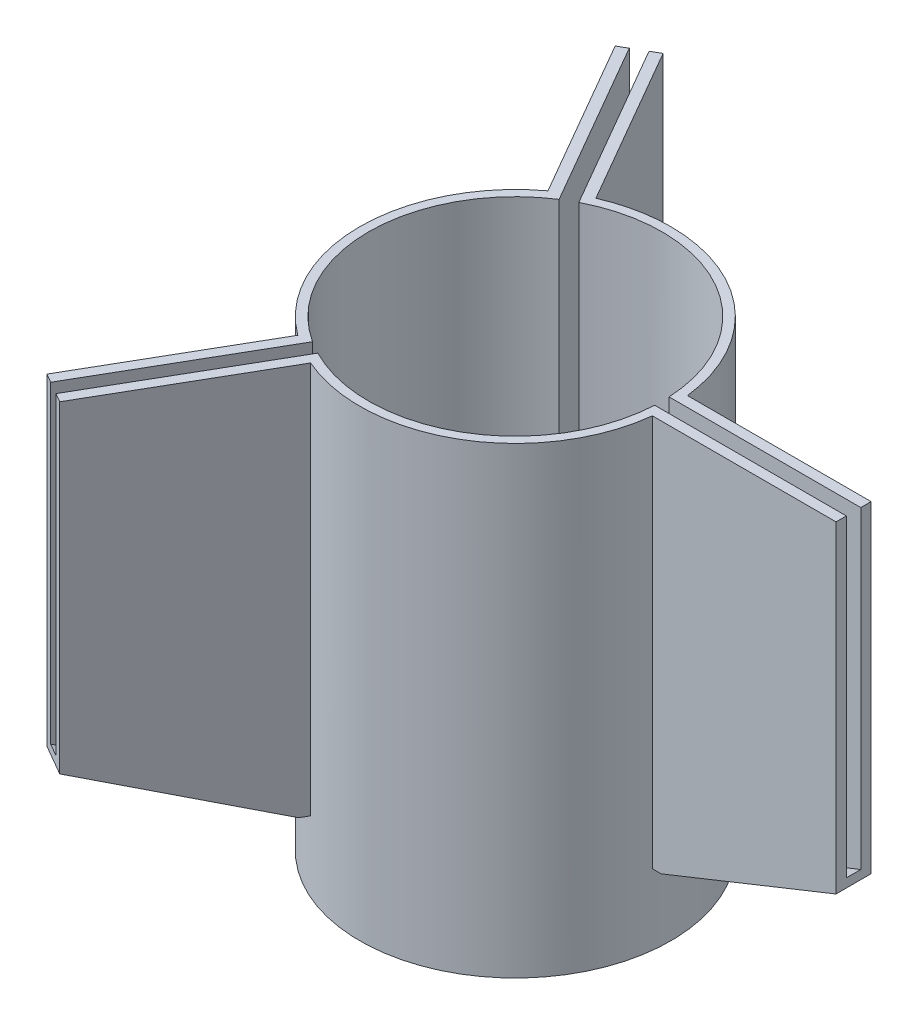
ISO-10303-21;
HEADER;
FILE_DESCRIPTION(('STEP AP214'),'2;1');
FILE_NAME('part.step','',(''),(''),'','','');
FILE_SCHEMA(('AUTOMOTIVE_DESIGN { 1 0 10303 214 1 1 1 1 }'));
ENDSEC;
DATA;
#1=APPLICATION_CONTEXT('core data for automotive mechanical design processes');
#2=APPLICATION_PROTOCOL_DEFINITION('international standard','automotive_design',2000,#1);
#3=PRODUCT_CONTEXT('',#1,'mechanical');
#4=PRODUCT('Part','Part','',(#3));
#5=PRODUCT_RELATED_PRODUCT_CATEGORY('part','',(#4));
#6=PRODUCT_DEFINITION_FORMATION('','',#4);
#7=PRODUCT_DEFINITION_CONTEXT('part definition',#1,'design');
#8=PRODUCT_DEFINITION('design','',#6,#7);
#9=PRODUCT_DEFINITION_SHAPE('','',#8);
#10=(LENGTH_UNIT() NAMED_UNIT(*) SI_UNIT(.MILLI.,.METRE.));
#11=(NAMED_UNIT(*) PLANE_ANGLE_UNIT() SI_UNIT($,.RADIAN.));
#12=(NAMED_UNIT(*) SI_UNIT($,.STERADIAN.) SOLID_ANGLE_UNIT());
#13=UNCERTAINTY_MEASURE_WITH_UNIT(LENGTH_MEASURE(1.E-05),#10,'distance_accuracy_value','');
#14=(GEOMETRIC_REPRESENTATION_CONTEXT(3) GLOBAL_UNCERTAINTY_ASSIGNED_CONTEXT((#13)) GLOBAL_UNIT_ASSIGNED_CONTEXT((#10,
#11,#12)) REPRESENTATION_CONTEXT('',''));
#15=CARTESIAN_POINT('',(0.,0.,0.));
#16=DIRECTION('',(0.,0.,1.));
#17=DIRECTION('',(1.,0.,0.));
#18=AXIS2_PLACEMENT_3D('',#15,#16,#17);
#19=CARTESIAN_POINT('',(0.,135.,0.));
#20=DIRECTION('',(0.,1.,0.));
#21=DIRECTION('',(0.,0.,1.));
#22=AXIS2_PLACEMENT_3D('',#19,#20,#21);
#23=PLANE('',#22);
#24=DIRECTION('',(0.499999999999992,0.,-0.866025403784443));
#25=VECTOR('',#24,1.);
#26=CARTESIAN_POINT('',(-38.1506822640858,135.,61.1789200248148));
#27=LINE('',#26,#25);
#28=CARTESIAN_POINT('',(-59.4665806125254,135.,98.0991389732865));
#29=VERTEX_POINT('',#28);
#30=CARTESIAN_POINT('',(-26.9665806125259,135.,41.8074877272976));
#31=VERTEX_POINT('',#30);
#32=EDGE_CURVE('E283',#29,#31,#27,.T.);
#33=ORIENTED_EDGE('',*,*,#32,.T.);
#34=CARTESIAN_POINT('',(0.,135.,0.));
#35=DIRECTION('',(0.,1.,0.));
#36=DIRECTION('',(0.,0.,1.));
#37=AXIS2_PLACEMENT_3D('',#34,#35,#36);
#38=CIRCLE('',#37,49.75);
#39=CARTESIAN_POINT('',(-26.9665806125265,135.,-41.8074877272973));
#40=VERTEX_POINT('',#39);
#41=EDGE_CURVE('E358',#40,#31,#38,.T.);
#42=ORIENTED_EDGE('',*,*,#41,.F.);
#43=DIRECTION('',(0.500000000000004,0.,0.866025403784436));
#44=VECTOR('',#43,1.);
#45=CARTESIAN_POINT('',(-38.1506822640868,135.,-61.1789200248145));
#46=LINE('',#45,#44);
#47=CARTESIAN_POINT('',(-59.4665806125267,135.,-98.0991389732857));
#48=VERTEX_POINT('',#47);
#49=EDGE_CURVE('E295',#48,#40,#46,.T.);
#50=ORIENTED_EDGE('',*,*,#49,.F.);
#51=DIRECTION('',(-0.866025403784436,0.,0.500000000000004));
#52=VECTOR('',#51,1.);
#53=CARTESIAN_POINT('',(-59.4665806125267,135.,-98.0991389732857));
#54=LINE('',#53,#52);
#55=CARTESIAN_POINT('',(-62.4976695257723,135.,-96.3491389732856));
#56=VERTEX_POINT('',#55);
#57=EDGE_CURVE('E270',#48,#56,#54,.T.);
#58=ORIENTED_EDGE('',*,*,#57,.T.);
#59=DIRECTION('',(0.500000000000004,0.,0.866025403784436));
#60=VECTOR('',#59,1.);
#61=CARTESIAN_POINT('',(-62.4976695257723,135.,-96.3491389732856));
#62=LINE('',#61,#60);
#63=CARTESIAN_POINT('',(-31.3595296906307,135.,-42.4162987256367));
#64=VERTEX_POINT('',#63);
#65=EDGE_CURVE('E274',#56,#64,#62,.T.);
#66=ORIENTED_EDGE('',*,*,#65,.T.);
#67=CARTESIAN_POINT('',(0.,135.,0.));
#68=DIRECTION('',(0.,1.,0.));
#69=DIRECTION('',(0.,0.,1.));
#70=AXIS2_PLACEMENT_3D('',#67,#68,#69);
#71=CIRCLE('',#70,52.75);
#72=CARTESIAN_POINT('',(-31.3595296906302,135.,42.4162987256371));
#73=VERTEX_POINT('',#72);
#74=EDGE_CURVE('E366',#64,#73,#71,.T.);
#75=ORIENTED_EDGE('',*,*,#74,.T.);
#76=DIRECTION('',(-0.499999999999992,0.,0.866025403784443));
#77=VECTOR('',#76,1.);
#78=CARTESIAN_POINT('',(-62.4976695257709,135.,96.3491389732865));
#79=LINE('',#78,#77);
#80=CARTESIAN_POINT('',(-62.4976695257709,135.,96.3491389732865));
#81=VERTEX_POINT('',#80);
#82=EDGE_CURVE('E444',#73,#81,#79,.T.);
#83=ORIENTED_EDGE('',*,*,#82,.T.);
#84=DIRECTION('',(0.866025403784443,0.,0.499999999999992));
#85=VECTOR('',#84,1.);
#86=CARTESIAN_POINT('',(-59.4665806125254,135.,98.0991389732865));
#87=LINE('',#86,#85);
#88=EDGE_CURVE('E447',#81,#29,#87,.T.);
#89=ORIENTED_EDGE('',*,*,#88,.T.);
#90=EDGE_LOOP('',(#33,#42,#50,#58,#66,#75,#83,#89));
#91=FACE_BOUND('',#90,.T.);
#92=ADVANCED_FACE('F35',(#91),#23,.T.);
#93=DIRECTION('',(0.500000000000004,0.,0.866025403784436));
#94=VECTOR('',#93,1.);
#95=CARTESIAN_POINT('',(-33.907157785543,135.,-63.6289200248145));
#96=LINE('',#95,#94);
#97=CARTESIAN_POINT('',(-55.223056133983,135.,-100.549138973286));
#98=VERTEX_POINT('',#97);
#99=CARTESIAN_POINT('',(-22.7230561339827,135.,-44.2574877272973));
#100=VERTEX_POINT('',#99);
#101=EDGE_CURVE('E292',#98,#100,#96,.T.);
#102=ORIENTED_EDGE('',*,*,#101,.T.);
#103=CARTESIAN_POINT('',(49.6896367465088,135.,-2.44999999999998));
#104=VERTEX_POINT('',#103);
#105=EDGE_CURVE('E355',#104,#100,#38,.T.);
#106=ORIENTED_EDGE('',*,*,#105,.F.);
#107=DIRECTION('',(-1.,0.,0.));
#108=VECTOR('',#107,1.);
#109=CARTESIAN_POINT('',(52.75,135.,-2.44999999999998));
#110=LINE('',#109,#108);
#111=CARTESIAN_POINT('',(114.689636746509,135.,-2.44999999999999));
#112=VERTEX_POINT('',#111);
#113=EDGE_CURVE('E350',#112,#104,#110,.T.);
#114=ORIENTED_EDGE('',*,*,#113,.F.);
#115=DIRECTION('',(0.,0.,-1.));
#116=VECTOR('',#115,1.);
#117=CARTESIAN_POINT('',(114.689636746509,135.,-2.44999999999999));
#118=LINE('',#117,#116);
#119=CARTESIAN_POINT('',(114.689636746509,135.,-5.94999999999999));
#120=VERTEX_POINT('',#119);
#121=EDGE_CURVE('E334',#112,#120,#118,.T.);
#122=ORIENTED_EDGE('',*,*,#121,.T.);
#123=DIRECTION('',(-1.,0.,0.));
#124=VECTOR('',#123,1.);
#125=CARTESIAN_POINT('',(114.689636746509,135.,-5.94999999999999));
#126=LINE('',#125,#124);
#127=CARTESIAN_POINT('',(52.4133570762263,135.,-5.94999999999998));
#128=VERTEX_POINT('',#127);
#129=EDGE_CURVE('E338',#120,#128,#126,.T.);
#130=ORIENTED_EDGE('',*,*,#129,.T.);
#131=CARTESIAN_POINT('',(-21.0538273855959,135.,-48.3662987256367));
#132=VERTEX_POINT('',#131);
#133=EDGE_CURVE('E362',#128,#132,#71,.T.);
#134=ORIENTED_EDGE('',*,*,#133,.T.);
#135=DIRECTION('',(-0.500000000000004,0.,-0.866025403784436));
#136=VECTOR('',#135,1.);
#137=CARTESIAN_POINT('',(-52.1919672207375,135.,-102.299138973286));
#138=LINE('',#137,#136);
#139=CARTESIAN_POINT('',(-52.1919672207375,135.,-102.299138973286));
#140=VERTEX_POINT('',#139);
#141=EDGE_CURVE('E255',#132,#140,#138,.T.);
#142=ORIENTED_EDGE('',*,*,#141,.T.);
#143=DIRECTION('',(-0.866025403784436,0.,0.500000000000004));
#144=VECTOR('',#143,1.);
#145=CARTESIAN_POINT('',(-55.223056133983,135.,-100.549138973286));
#146=LINE('',#145,#144);
#147=EDGE_CURVE('E259',#140,#98,#146,.T.);
#148=ORIENTED_EDGE('',*,*,#147,.T.);
#149=EDGE_LOOP('',(#102,#106,#114,#122,#130,#134,#142,#148));
#150=FACE_BOUND('',#149,.T.);
#151=ADVANCED_FACE('F520',(#150),#23,.T.);
#152=CARTESIAN_POINT('',(-22.7230561339821,135.,44.2574877272976));
#153=VERTEX_POINT('',#152);
#154=CARTESIAN_POINT('',(49.6896367465088,135.,2.45000000000002));
#155=VERTEX_POINT('',#154);
#156=EDGE_CURVE('E359',#153,#155,#38,.T.);
#157=ORIENTED_EDGE('',*,*,#156,.F.);
#158=DIRECTION('',(0.499999999999992,0.,-0.866025403784443));
#159=VECTOR('',#158,1.);
#160=CARTESIAN_POINT('',(-33.907157785542,135.,63.6289200248147));
#161=LINE('',#160,#159);
#162=CARTESIAN_POINT('',(-55.2230561339816,135.,100.549138973286));
#163=VERTEX_POINT('',#162);
#164=EDGE_CURVE('E286',#163,#153,#161,.T.);
#165=ORIENTED_EDGE('',*,*,#164,.F.);
#166=DIRECTION('',(0.866025403784443,0.,0.499999999999992));
#167=VECTOR('',#166,1.);
#168=CARTESIAN_POINT('',(-55.2230561339816,135.,100.549138973286));
#169=LINE('',#168,#167);
#170=CARTESIAN_POINT('',(-52.1919672207361,135.,102.299138973286));
#171=VERTEX_POINT('',#170);
#172=EDGE_CURVE('E452',#163,#171,#169,.T.);
#173=ORIENTED_EDGE('',*,*,#172,.T.);
#174=DIRECTION('',(0.499999999999992,0.,-0.866025403784443));
#175=VECTOR('',#174,1.);
#176=CARTESIAN_POINT('',(-52.1919672207361,135.,102.299138973286));
#177=LINE('',#176,#175);
#178=CARTESIAN_POINT('',(-21.0538273855953,135.,48.366298725637));
#179=VERTEX_POINT('',#178);
#180=EDGE_CURVE('E254',#171,#179,#177,.T.);
#181=ORIENTED_EDGE('',*,*,#180,.T.);
#182=CARTESIAN_POINT('',(52.4133570762263,135.,5.95000000000002));
#183=VERTEX_POINT('',#182);
#184=EDGE_CURVE('E56',#179,#183,#71,.T.);
#185=ORIENTED_EDGE('',*,*,#184,.T.);
#186=DIRECTION('',(1.,0.,0.));
#187=VECTOR('',#186,1.);
#188=CARTESIAN_POINT('',(114.689636746509,135.,5.95000000000001));
#189=LINE('',#188,#187);
#190=CARTESIAN_POINT('',(114.689636746509,135.,5.95000000000001));
#191=VERTEX_POINT('',#190);
#192=EDGE_CURVE('E325',#183,#191,#189,.T.);
#193=ORIENTED_EDGE('',*,*,#192,.T.);
#194=DIRECTION('',(0.,0.,-1.));
#195=VECTOR('',#194,1.);
#196=CARTESIAN_POINT('',(114.689636746509,135.,2.45000000000001));
#197=LINE('',#196,#195);
#198=CARTESIAN_POINT('',(114.689636746509,135.,2.45000000000001));
#199=VERTEX_POINT('',#198);
#200=EDGE_CURVE('E328',#191,#199,#197,.T.);
#201=ORIENTED_EDGE('',*,*,#200,.T.);
#202=DIRECTION('',(-1.,0.,0.));
#203=VECTOR('',#202,1.);
#204=CARTESIAN_POINT('',(52.75,135.,2.45000000000002));
#205=LINE('',#204,#203);
#206=EDGE_CURVE('E347',#199,#155,#205,.T.);
#207=ORIENTED_EDGE('',*,*,#206,.T.);
#208=EDGE_LOOP('',(#157,#165,#173,#181,#185,#193,#201,#207));
#209=FACE_BOUND('',#208,.T.);
#210=ADVANCED_FACE('F456',(#209),#23,.T.);
#211=CARTESIAN_POINT('',(0.,135.,0.));
#212=DIRECTION('',(0.,-1.,0.));
#213=DIRECTION('',(0.,0.,-1.));
#214=AXIS2_PLACEMENT_3D('',#211,#212,#213);
#215=CYLINDRICAL_SURFACE('',#214,52.75);
#216=DIRECTION('',(0.,-1.,0.));
#217=VECTOR('',#216,1.);
#218=CARTESIAN_POINT('',(-21.0538273855953,135.,48.366298725637));
#219=LINE('',#218,#217);
#220=CARTESIAN_POINT('',(-21.0538273855953,2.,48.366298725637));
#221=VERTEX_POINT('',#220);
#222=EDGE_CURVE('E402',#179,#221,#219,.T.);
#223=ORIENTED_EDGE('',*,*,#222,.T.);
#224=CARTESIAN_POINT('',(0.,2.,0.));
#225=DIRECTION('',(0.,-1.,0.));
#226=DIRECTION('',(0.,0.,-1.));
#227=AXIS2_PLACEMENT_3D('',#224,#225,#226);
#228=CIRCLE('',#227,52.75);
#229=CARTESIAN_POINT('',(-31.3595296906302,2.,42.4162987256371));
#230=VERTEX_POINT('',#229);
#231=EDGE_CURVE('E11',#221,#230,#228,.T.);
#232=ORIENTED_EDGE('',*,*,#231,.T.);
#233=DIRECTION('',(0.,-1.,0.));
#234=VECTOR('',#233,1.);
#235=CARTESIAN_POINT('',(-31.3595296906302,135.,42.4162987256371));
#236=LINE('',#235,#234);
#237=EDGE_CURVE('E49',#230,#73,#236,.F.);
#238=ORIENTED_EDGE('',*,*,#237,.T.);
#239=ORIENTED_EDGE('',*,*,#74,.F.);
#240=DIRECTION('',(0.,-1.,0.));
#241=VECTOR('',#240,1.);
#242=CARTESIAN_POINT('',(-31.3595296906307,135.,-42.4162987256367));
#243=LINE('',#242,#241);
#244=CARTESIAN_POINT('',(-31.3595296906307,2.,-42.4162987256367));
#245=VERTEX_POINT('',#244);
#246=EDGE_CURVE('E398',#64,#245,#243,.T.);
#247=ORIENTED_EDGE('',*,*,#246,.T.);
#248=CARTESIAN_POINT('',(0.,2.,0.));
#249=DIRECTION('',(0.,-1.,0.));
#250=DIRECTION('',(0.,0.,-1.));
#251=AXIS2_PLACEMENT_3D('',#248,#249,#250);
#252=CIRCLE('',#251,52.75);
#253=CARTESIAN_POINT('',(-21.0538273855959,2.,-48.3662987256368));
#254=VERTEX_POINT('',#253);
#255=EDGE_CURVE('E43',#245,#254,#252,.T.);
#256=ORIENTED_EDGE('',*,*,#255,.T.);
#257=DIRECTION('',(0.,-1.,0.));
#258=VECTOR('',#257,1.);
#259=CARTESIAN_POINT('',(-21.0538273855959,135.,-48.3662987256368));
#260=LINE('',#259,#258);
#261=EDGE_CURVE('E400',#254,#132,#260,.F.);
#262=ORIENTED_EDGE('',*,*,#261,.T.);
#263=ORIENTED_EDGE('',*,*,#133,.F.);
#264=DIRECTION('',(0.,-1.,0.));
#265=VECTOR('',#264,1.);
#266=CARTESIAN_POINT('',(52.4133570762263,135.,-5.94999999999998));
#267=LINE('',#266,#265);
#268=CARTESIAN_POINT('',(52.4133570762263,2.,-5.94999999999998));
#269=VERTEX_POINT('',#268);
#270=EDGE_CURVE('E375',#128,#269,#267,.T.);
#271=ORIENTED_EDGE('',*,*,#270,.T.);
#272=CARTESIAN_POINT('',(0.,2.,0.));
#273=DIRECTION('',(0.,-1.,0.));
#274=DIRECTION('',(0.,0.,-1.));
#275=AXIS2_PLACEMENT_3D('',#272,#273,#274);
#276=CIRCLE('',#275,52.75);
#277=CARTESIAN_POINT('',(52.4133570762263,2.,5.95000000000002));
#278=VERTEX_POINT('',#277);
#279=EDGE_CURVE('E379',#269,#278,#276,.T.);
#280=ORIENTED_EDGE('',*,*,#279,.T.);
#281=DIRECTION('',(0.,-1.,0.));
#282=VECTOR('',#281,1.);
#283=CARTESIAN_POINT('',(52.4133570762263,135.,5.95000000000002));
#284=LINE('',#283,#282);
#285=EDGE_CURVE('E377',#278,#183,#284,.F.);
#286=ORIENTED_EDGE('',*,*,#285,.T.);
#287=ORIENTED_EDGE('',*,*,#184,.F.);
#288=EDGE_LOOP('',(#223,#232,#238,#239,#247,#256,#262,#263,#271,#280,#286,#287));
#289=FACE_BOUND('',#288,.T.);
#290=CARTESIAN_POINT('',(0.,-22.,0.));
#291=DIRECTION('',(0.,-1.,0.));
#292=DIRECTION('',(0.,0.,-1.));
#293=AXIS2_PLACEMENT_3D('',#290,#291,#292);
#294=CIRCLE('',#293,52.75);
#295=CARTESIAN_POINT('',(0.,-22.,-52.75));
#296=VERTEX_POINT('',#295);
#297=EDGE_CURVE('E982',#296,#296,#294,.T.);
#298=ORIENTED_EDGE('',*,*,#297,.F.);
#299=EDGE_LOOP('',(#298));
#300=FACE_BOUND('',#299,.T.);
#301=ADVANCED_FACE('F37',(#289,#300),#215,.T.);
#302=CARTESIAN_POINT('',(0.,135.,0.));
#303=DIRECTION('',(0.,-1.,0.));
#304=DIRECTION('',(0.,0.,-1.));
#305=AXIS2_PLACEMENT_3D('',#302,#303,#304);
#306=CYLINDRICAL_SURFACE('',#305,49.75);
#307=CARTESIAN_POINT('',(0.,0.,0.));
#308=DIRECTION('',(0.,1.,0.));
#309=DIRECTION('',(0.,0.,1.));
#310=AXIS2_PLACEMENT_3D('',#307,#308,#309);
#311=CIRCLE('',#310,49.75);
#312=CARTESIAN_POINT('',(0.,0.,49.75));
#313=VERTEX_POINT('',#312);
#314=EDGE_CURVE('E354',#313,#313,#311,.T.);
#315=ORIENTED_EDGE('',*,*,#314,.F.);
#316=EDGE_LOOP('',(#315));
#317=FACE_BOUND('',#316,.T.);
#318=CARTESIAN_POINT('',(0.,5.,0.));
#319=DIRECTION('',(0.,1.,0.));
#320=DIRECTION('',(0.,0.,1.));
#321=AXIS2_PLACEMENT_3D('',#318,#319,#320);
#322=CIRCLE('',#321,49.75);
#323=CARTESIAN_POINT('',(-22.7230561339827,5.,-44.2574877272973));
#324=VERTEX_POINT('',#323);
#325=CARTESIAN_POINT('',(-26.9665806125265,5.,-41.8074877272973));
#326=VERTEX_POINT('',#325);
#327=EDGE_CURVE('E389',#324,#326,#322,.T.);
#328=ORIENTED_EDGE('',*,*,#327,.T.);
#329=DIRECTION('',(0.,-1.,0.));
#330=VECTOR('',#329,1.);
#331=CARTESIAN_POINT('',(-26.9665806125265,135.,-41.8074877272973));
#332=LINE('',#331,#330);
#333=EDGE_CURVE('E395',#326,#40,#332,.F.);
#334=ORIENTED_EDGE('',*,*,#333,.T.);
#335=ORIENTED_EDGE('',*,*,#41,.T.);
#336=DIRECTION('',(0.,-1.,0.));
#337=VECTOR('',#336,1.);
#338=CARTESIAN_POINT('',(-26.9665806125259,135.,41.8074877272976));
#339=LINE('',#338,#337);
#340=CARTESIAN_POINT('',(-26.9665806125259,5.,41.8074877272976));
#341=VERTEX_POINT('',#340);
#342=EDGE_CURVE('E388',#31,#341,#339,.T.);
#343=ORIENTED_EDGE('',*,*,#342,.T.);
#344=CARTESIAN_POINT('',(-22.7230561339821,5.,44.2574877272976));
#345=VERTEX_POINT('',#344);
#346=EDGE_CURVE('E385',#341,#345,#322,.T.);
#347=ORIENTED_EDGE('',*,*,#346,.T.);
#348=DIRECTION('',(0.,-1.,0.));
#349=VECTOR('',#348,1.);
#350=CARTESIAN_POINT('',(-22.7230561339821,135.,44.2574877272976));
#351=LINE('',#350,#349);
#352=EDGE_CURVE('E382',#345,#153,#351,.F.);
#353=ORIENTED_EDGE('',*,*,#352,.T.);
#354=ORIENTED_EDGE('',*,*,#156,.T.);
#355=DIRECTION('',(0.,-1.,0.));
#356=VECTOR('',#355,1.);
#357=CARTESIAN_POINT('',(49.6896367465088,135.,2.45000000000002));
#358=LINE('',#357,#356);
#359=CARTESIAN_POINT('',(49.6896367465088,5.,2.45000000000002));
#360=VERTEX_POINT('',#359);
#361=EDGE_CURVE('E365',#155,#360,#358,.T.);
#362=ORIENTED_EDGE('',*,*,#361,.T.);
#363=CARTESIAN_POINT('',(0.,5.,0.));
#364=DIRECTION('',(0.,1.,0.));
#365=DIRECTION('',(0.,0.,1.));
#366=AXIS2_PLACEMENT_3D('',#363,#364,#365);
#367=CIRCLE('',#366,49.75);
#368=CARTESIAN_POINT('',(49.6896367465088,5.,-2.44999999999999));
#369=VERTEX_POINT('',#368);
#370=EDGE_CURVE('E369',#360,#369,#367,.T.);
#371=ORIENTED_EDGE('',*,*,#370,.T.);
#372=DIRECTION('',(0.,-1.,0.));
#373=VECTOR('',#372,1.);
#374=CARTESIAN_POINT('',(49.6896367465088,135.,-2.44999999999998));
#375=LINE('',#374,#373);
#376=EDGE_CURVE('E372',#369,#104,#375,.F.);
#377=ORIENTED_EDGE('',*,*,#376,.T.);
#378=ORIENTED_EDGE('',*,*,#105,.T.);
#379=DIRECTION('',(0.,-1.,0.));
#380=VECTOR('',#379,1.);
#381=CARTESIAN_POINT('',(-22.7230561339827,135.,-44.2574877272973));
#382=LINE('',#381,#380);
#383=EDGE_CURVE('E392',#100,#324,#382,.T.);
#384=ORIENTED_EDGE('',*,*,#383,.T.);
#385=EDGE_LOOP('',(#328,#334,#335,#343,#347,#353,#354,#362,#371,#377,#378,#384));
#386=FACE_BOUND('',#385,.T.);
#387=ADVANCED_FACE('F478',(#317,#386),#306,.F.);
#388=CARTESIAN_POINT('',(52.75,5.,0.));
#389=DIRECTION('',(0.,1.,0.));
#390=DIRECTION('',(0.,0.,1.));
#391=AXIS2_PLACEMENT_3D('',#388,#389,#390);
#392=PLANE('',#391);
#393=ORIENTED_EDGE('',*,*,#370,.F.);
#394=DIRECTION('',(-1.,0.,0.));
#395=VECTOR('',#394,1.);
#396=CARTESIAN_POINT('',(52.75,5.,2.45));
#397=LINE('',#396,#395);
#398=CARTESIAN_POINT('',(55.4133570762263,5.00000000000001,2.45000000000001));
#399=VERTEX_POINT('',#398);
#400=EDGE_CURVE('E344',#399,#360,#397,.T.);
#401=ORIENTED_EDGE('',*,*,#400,.F.);
#402=DIRECTION('',(0.,0.,1.));
#403=VECTOR('',#402,1.);
#404=CARTESIAN_POINT('',(55.4133570762263,5.00000000000001,-73.7120549779982));
#405=LINE('',#404,#403);
#406=CARTESIAN_POINT('',(55.4133570762263,5.00000000000001,-2.44999999999999));
#407=VERTEX_POINT('',#406);
#408=EDGE_CURVE('E311',#407,#399,#405,.T.);
#409=ORIENTED_EDGE('',*,*,#408,.F.);
#410=DIRECTION('',(-1.,0.,0.));
#411=VECTOR('',#410,1.);
#412=CARTESIAN_POINT('',(52.75,5.,-2.44999999999999));
#413=LINE('',#412,#411);
#414=EDGE_CURVE('E352',#407,#369,#413,.T.);
#415=ORIENTED_EDGE('',*,*,#414,.T.);
#416=EDGE_LOOP('',(#393,#401,#409,#415));
#417=FACE_BOUND('',#416,.T.);
#418=ADVANCED_FACE('F570',(#417),#392,.T.);
#419=CARTESIAN_POINT('',(52.75,5.,-2.44999999999999));
#420=DIRECTION('',(0.,0.,1.));
#421=DIRECTION('',(0.,-1.,0.));
#422=AXIS2_PLACEMENT_3D('',#419,#420,#421);
#423=PLANE('',#422);
#424=DIRECTION('',(-0.928485826880913,-0.371367835550236,0.));
#425=VECTOR('',#424,1.);
#426=CARTESIAN_POINT('',(53.1173144123314,4.08164845414383,-2.44999999999999));
#427=LINE('',#426,#425);
#428=CARTESIAN_POINT('',(114.689636746509,28.7088203646287,-2.44999999999999));
#429=VERTEX_POINT('',#428);
#430=EDGE_CURVE('E322',#429,#407,#427,.T.);
#431=ORIENTED_EDGE('',*,*,#430,.F.);
#432=DIRECTION('',(0.,1.,0.));
#433=VECTOR('',#432,1.);
#434=CARTESIAN_POINT('',(114.689636746509,-60.0941625647031,-2.44999999999999));
#435=LINE('',#434,#433);
#436=EDGE_CURVE('E341',#429,#112,#435,.T.);
#437=ORIENTED_EDGE('',*,*,#436,.T.);
#438=ORIENTED_EDGE('',*,*,#113,.T.);
#439=ORIENTED_EDGE('',*,*,#376,.F.);
#440=ORIENTED_EDGE('',*,*,#414,.F.);
#441=EDGE_LOOP('',(#431,#437,#438,#439,#440));
#442=FACE_BOUND('',#441,.T.);
#443=ADVANCED_FACE('F535',(#442),#423,.T.);
#444=CARTESIAN_POINT('',(52.75,135.,2.45000000000002));
#445=DIRECTION('',(0.,0.,-1.));
#446=DIRECTION('',(0.,1.,0.));
#447=AXIS2_PLACEMENT_3D('',#444,#445,#446);
#448=PLANE('',#447);
#449=DIRECTION('',(0.928485826880913,0.371367835550236,0.));
#450=VECTOR('',#449,1.);
#451=CARTESIAN_POINT('',(97.9425847551501,22.0104774607086,2.45));
#452=LINE('',#451,#450);
#453=CARTESIAN_POINT('',(114.689636746509,28.7088203646287,2.45000000000001));
#454=VERTEX_POINT('',#453);
#455=EDGE_CURVE('E314',#399,#454,#452,.T.);
#456=ORIENTED_EDGE('',*,*,#455,.F.);
#457=ORIENTED_EDGE('',*,*,#400,.T.);
#458=ORIENTED_EDGE('',*,*,#361,.F.);
#459=ORIENTED_EDGE('',*,*,#206,.F.);
#460=DIRECTION('',(0.,1.,0.));
#461=VECTOR('',#460,1.);
#462=CARTESIAN_POINT('',(114.689636746509,-60.0941625647031,2.45000000000001));
#463=LINE('',#462,#461);
#464=EDGE_CURVE('E332',#454,#199,#463,.T.);
#465=ORIENTED_EDGE('',*,*,#464,.F.);
#466=EDGE_LOOP('',(#456,#457,#458,#459,#465));
#467=FACE_BOUND('',#466,.T.);
#468=ADVANCED_FACE('F474',(#467),#448,.T.);
#469=CARTESIAN_POINT('',(114.689636746509,-60.0941625647031,-5.94999999999999));
#470=DIRECTION('',(0.,0.,-1.));
#471=DIRECTION('',(-1.,0.,0.));
#472=AXIS2_PLACEMENT_3D('',#469,#470,#471);
#473=PLANE('',#472);
#474=DIRECTION('',(0.,1.,0.));
#475=VECTOR('',#474,1.);
#476=CARTESIAN_POINT('',(114.689636746509,-60.0941625647031,-5.94999999999999));
#477=LINE('',#476,#475);
#478=CARTESIAN_POINT('',(114.689636746509,25.7088203646287,-5.94999999999999));
#479=VERTEX_POINT('',#478);
#480=EDGE_CURVE('E342',#479,#120,#477,.T.);
#481=ORIENTED_EDGE('',*,*,#480,.F.);
#482=DIRECTION('',(0.928485826880913,0.371367835550236,0.));
#483=VECTOR('',#482,1.);
#484=CARTESIAN_POINT('',(55.4133570762263,2.00000000000001,-5.94999999999998));
#485=LINE('',#484,#483);
#486=CARTESIAN_POINT('',(55.4133570762263,2.,-5.94999999999998));
#487=VERTEX_POINT('',#486);
#488=EDGE_CURVE('E305',#487,#479,#485,.T.);
#489=ORIENTED_EDGE('',*,*,#488,.F.);
#490=DIRECTION('',(1.,0.,0.));
#491=VECTOR('',#490,1.);
#492=CARTESIAN_POINT('',(52.4133570762263,2.,-5.94999999999998));
#493=LINE('',#492,#491);
#494=EDGE_CURVE('E302',#269,#487,#493,.T.);
#495=ORIENTED_EDGE('',*,*,#494,.F.);
#496=ORIENTED_EDGE('',*,*,#270,.F.);
#497=ORIENTED_EDGE('',*,*,#129,.F.);
#498=EDGE_LOOP('',(#481,#489,#495,#496,#497));
#499=FACE_BOUND('',#498,.T.);
#500=ADVANCED_FACE('F540',(#499),#473,.T.);
#501=CARTESIAN_POINT('',(114.689636746509,-60.0941625647031,-2.44999999999999));
#502=DIRECTION('',(1.,0.,0.));
#503=DIRECTION('',(0.,0.,-1.));
#504=AXIS2_PLACEMENT_3D('',#501,#502,#503);
#505=PLANE('',#504);
#506=DIRECTION('',(0.,0.,1.));
#507=VECTOR('',#506,1.);
#508=CARTESIAN_POINT('',(114.689636746509,25.7088203646287,-73.7120549779982));
#509=LINE('',#508,#507);
#510=CARTESIAN_POINT('',(114.689636746509,25.7088203646287,5.95000000000001));
#511=VERTEX_POINT('',#510);
#512=EDGE_CURVE('E307',#479,#511,#509,.T.);
#513=ORIENTED_EDGE('',*,*,#512,.F.);
#514=ORIENTED_EDGE('',*,*,#480,.T.);
#515=ORIENTED_EDGE('',*,*,#121,.F.);
#516=ORIENTED_EDGE('',*,*,#436,.F.);
#517=DIRECTION('',(0.,0.,1.));
#518=VECTOR('',#517,1.);
#519=CARTESIAN_POINT('',(114.689636746509,28.7088203646287,-73.7120549779982));
#520=LINE('',#519,#518);
#521=EDGE_CURVE('E315',#429,#454,#520,.T.);
#522=ORIENTED_EDGE('',*,*,#521,.T.);
#523=ORIENTED_EDGE('',*,*,#464,.T.);
#524=ORIENTED_EDGE('',*,*,#200,.F.);
#525=DIRECTION('',(0.,1.,0.));
#526=VECTOR('',#525,1.);
#527=CARTESIAN_POINT('',(114.689636746509,-60.0941625647031,5.95000000000001));
#528=LINE('',#527,#526);
#529=EDGE_CURVE('E331',#511,#191,#528,.T.);
#530=ORIENTED_EDGE('',*,*,#529,.F.);
#531=EDGE_LOOP('',(#513,#514,#515,#516,#522,#523,#524,#530));
#532=FACE_BOUND('',#531,.T.);
#533=ADVANCED_FACE('F467',(#532),#505,.T.);
#534=CARTESIAN_POINT('',(114.689636746509,-60.0941625647031,5.95000000000001));
#535=DIRECTION('',(0.,0.,1.));
#536=DIRECTION('',(1.,0.,0.));
#537=AXIS2_PLACEMENT_3D('',#534,#535,#536);
#538=PLANE('',#537);
#539=DIRECTION('',(0.928485826880913,0.371367835550236,0.));
#540=VECTOR('',#539,1.);
#541=CARTESIAN_POINT('',(55.4133570762263,2.,5.95000000000002));
#542=LINE('',#541,#540);
#543=CARTESIAN_POINT('',(55.4133570762263,2.,5.95000000000002));
#544=VERTEX_POINT('',#543);
#545=EDGE_CURVE('E300',#544,#511,#542,.T.);
#546=ORIENTED_EDGE('',*,*,#545,.T.);
#547=ORIENTED_EDGE('',*,*,#529,.T.);
#548=ORIENTED_EDGE('',*,*,#192,.F.);
#549=ORIENTED_EDGE('',*,*,#285,.F.);
#550=DIRECTION('',(1.,0.,0.));
#551=VECTOR('',#550,1.);
#552=CARTESIAN_POINT('',(52.4133570762263,2.,5.95000000000002));
#553=LINE('',#552,#551);
#554=EDGE_CURVE('E299',#278,#544,#553,.T.);
#555=ORIENTED_EDGE('',*,*,#554,.T.);
#556=EDGE_LOOP('',(#546,#547,#548,#549,#555));
#557=FACE_BOUND('',#556,.T.);
#558=ADVANCED_FACE('F462',(#557),#538,.T.);
#559=CARTESIAN_POINT('',(52.4133570762263,2.,-73.7120549779982));
#560=DIRECTION('',(0.,-1.,0.));
#561=DIRECTION('',(0.,0.,-1.));
#562=AXIS2_PLACEMENT_3D('',#559,#560,#561);
#563=PLANE('',#562);
#564=ORIENTED_EDGE('',*,*,#279,.F.);
#565=ORIENTED_EDGE('',*,*,#494,.T.);
#566=DIRECTION('',(0.,0.,1.));
#567=VECTOR('',#566,1.);
#568=CARTESIAN_POINT('',(55.4133570762263,2.,-73.7120549779982));
#569=LINE('',#568,#567);
#570=EDGE_CURVE('E308',#487,#544,#569,.T.);
#571=ORIENTED_EDGE('',*,*,#570,.T.);
#572=ORIENTED_EDGE('',*,*,#554,.F.);
#573=EDGE_LOOP('',(#564,#565,#571,#572));
#574=FACE_BOUND('',#573,.T.);
#575=ADVANCED_FACE('F545',(#574),#563,.T.);
#576=CARTESIAN_POINT('',(55.4133570762263,2.,-73.7120549779982));
#577=DIRECTION('',(0.371367835550236,-0.928485826880913,0.));
#578=DIRECTION('',(0.928485826880913,0.371367835550236,0.));
#579=AXIS2_PLACEMENT_3D('',#576,#577,#578);
#580=PLANE('',#579);
#581=ORIENTED_EDGE('',*,*,#488,.T.);
#582=ORIENTED_EDGE('',*,*,#512,.T.);
#583=ORIENTED_EDGE('',*,*,#545,.F.);
#584=ORIENTED_EDGE('',*,*,#570,.F.);
#585=EDGE_LOOP('',(#581,#582,#583,#584));
#586=FACE_BOUND('',#585,.T.);
#587=ADVANCED_FACE('F547',(#586),#580,.T.);
#588=CARTESIAN_POINT('',(114.689636746509,28.7088203646287,-73.7120549779982));
#589=DIRECTION('',(-0.371367835550236,0.928485826880913,0.));
#590=DIRECTION('',(-0.928485826880913,-0.371367835550236,0.));
#591=AXIS2_PLACEMENT_3D('',#588,#589,#590);
#592=PLANE('',#591);
#593=ORIENTED_EDGE('',*,*,#521,.F.);
#594=ORIENTED_EDGE('',*,*,#430,.T.);
#595=ORIENTED_EDGE('',*,*,#408,.T.);
#596=ORIENTED_EDGE('',*,*,#455,.T.);
#597=EDGE_LOOP('',(#593,#594,#595,#596));
#598=FACE_BOUND('',#597,.T.);
#599=ADVANCED_FACE('F549',(#598),#592,.T.);
#600=CARTESIAN_POINT('',(-33.907157785542,5.,63.6289200248147));
#601=DIRECTION('',(-0.866025403784443,0.,-0.499999999999992));
#602=DIRECTION('',(-0.499999999999992,0.,0.866025403784443));
#603=AXIS2_PLACEMENT_3D('',#600,#601,#602);
#604=PLANE('',#603);
#605=DIRECTION('',(0.464242913440449,-0.371367835550236,-0.804092313132675));
#606=VECTOR('',#605,1.);
#607=CARTESIAN_POINT('',(-32.7594035965697,10.7391803769171,61.6409514549146));
#608=LINE('',#607,#606);
#609=CARTESIAN_POINT('',(-55.2230561339816,28.7088203646287,100.549138973286));
#610=VERTEX_POINT('',#609);
#611=CARTESIAN_POINT('',(-25.5849162988408,5.00000000000001,49.2143749369904));
#612=VERTEX_POINT('',#611);
#613=EDGE_CURVE('E512',#610,#612,#608,.T.);
#614=ORIENTED_EDGE('',*,*,#613,.F.);
#615=DIRECTION('',(0.,1.,0.));
#616=VECTOR('',#615,1.);
#617=CARTESIAN_POINT('',(-55.2230561339816,-63.0535932829554,100.549138973286));
#618=LINE('',#617,#616);
#619=EDGE_CURVE('E256',#610,#163,#618,.T.);
#620=ORIENTED_EDGE('',*,*,#619,.T.);
#621=ORIENTED_EDGE('',*,*,#164,.T.);
#622=ORIENTED_EDGE('',*,*,#352,.F.);
#623=DIRECTION('',(0.499999999999992,0.,-0.866025403784443));
#624=VECTOR('',#623,1.);
#625=CARTESIAN_POINT('',(-33.907157785542,5.,63.6289200248147));
#626=LINE('',#625,#624);
#627=EDGE_CURVE('E288',#612,#345,#626,.T.);
#628=ORIENTED_EDGE('',*,*,#627,.F.);
#629=EDGE_LOOP('',(#614,#620,#621,#622,#628));
#630=FACE_BOUND('',#629,.T.);
#631=ADVANCED_FACE('F501',(#630),#604,.T.);
#632=CARTESIAN_POINT('',(-38.1506822640858,135.,61.1789200248148));
#633=DIRECTION('',(0.866025403784443,0.,0.499999999999992));
#634=DIRECTION('',(0.499999999999992,0.,-0.866025403784443));
#635=AXIS2_PLACEMENT_3D('',#632,#633,#634);
#636=PLANE('',#635);
#637=DIRECTION('',(-0.464242913440449,0.371367835550236,0.804092313132675));
#638=VECTOR('',#637,1.);
#639=CARTESIAN_POINT('',(-59.4155632465224,28.6680093834818,98.010774303301));
#640=LINE('',#639,#638);
#641=CARTESIAN_POINT('',(-29.8284407773846,5.00000000000001,46.7643749369904));
#642=VERTEX_POINT('',#641);
#643=CARTESIAN_POINT('',(-59.4665806125254,28.7088203646287,98.0991389732865));
#644=VERTEX_POINT('',#643);
#645=EDGE_CURVE('E492',#642,#644,#640,.T.);
#646=ORIENTED_EDGE('',*,*,#645,.F.);
#647=DIRECTION('',(0.499999999999992,0.,-0.866025403784443));
#648=VECTOR('',#647,1.);
#649=CARTESIAN_POINT('',(-38.1506822640858,5.,61.1789200248148));
#650=LINE('',#649,#648);
#651=EDGE_CURVE('E280',#642,#341,#650,.T.);
#652=ORIENTED_EDGE('',*,*,#651,.T.);
#653=ORIENTED_EDGE('',*,*,#342,.F.);
#654=ORIENTED_EDGE('',*,*,#32,.F.);
#655=DIRECTION('',(0.,1.,0.));
#656=VECTOR('',#655,1.);
#657=CARTESIAN_POINT('',(-59.4665806125254,-63.0535932829554,98.0991389732865));
#658=LINE('',#657,#656);
#659=EDGE_CURVE('E450',#644,#29,#658,.T.);
#660=ORIENTED_EDGE('',*,*,#659,.F.);
#661=EDGE_LOOP('',(#646,#652,#653,#654,#660));
#662=FACE_BOUND('',#661,.T.);
#663=ADVANCED_FACE('F490',(#662),#636,.T.);
#664=CARTESIAN_POINT('',(-36.0289200248149,5.,-62.4039200248145));
#665=DIRECTION('',(0.,1.,0.));
#666=DIRECTION('',(0.,0.,1.));
#667=AXIS2_PLACEMENT_3D('',#664,#665,#666);
#668=PLANE('',#667);
#669=ORIENTED_EDGE('',*,*,#346,.F.);
#670=ORIENTED_EDGE('',*,*,#651,.F.);
#671=DIRECTION('',(-0.866025403784443,0.,-0.499999999999992));
#672=VECTOR('',#671,1.);
#673=CARTESIAN_POINT('',(185.64605836432,5.00000000000001,171.168635019951));
#674=LINE('',#673,#672);
#675=EDGE_CURVE('E497',#612,#642,#674,.T.);
#676=ORIENTED_EDGE('',*,*,#675,.F.);
#677=ORIENTED_EDGE('',*,*,#627,.T.);
#678=EDGE_LOOP('',(#669,#670,#676,#677));
#679=FACE_BOUND('',#678,.T.);
#680=ADVANCED_FACE('F496',(#679),#668,.T.);
#681=CARTESIAN_POINT('',(-38.1506822640868,5.,-61.1789200248145));
#682=DIRECTION('',(0.866025403784436,0.,-0.500000000000004));
#683=DIRECTION('',(-0.500000000000004,0.,-0.866025403784436));
#684=AXIS2_PLACEMENT_3D('',#681,#682,#683);
#685=PLANE('',#684);
#686=DIRECTION('',(0.46424291344046,-0.371367835550236,0.804092313132669));
#687=VECTOR('',#686,1.);
#688=CARTESIAN_POINT('',(-37.0029280751144,10.7391803769171,-59.1909514549143));
#689=LINE('',#688,#687);
#690=CARTESIAN_POINT('',(-59.4665806125267,28.7088203646287,-98.0991389732857));
#691=VERTEX_POINT('',#690);
#692=CARTESIAN_POINT('',(-29.8284407773852,5.00000000000001,-46.76437493699));
#693=VERTEX_POINT('',#692);
#694=EDGE_CURVE('E441',#691,#693,#689,.T.);
#695=ORIENTED_EDGE('',*,*,#694,.F.);
#696=DIRECTION('',(0.,1.,0.));
#697=VECTOR('',#696,1.);
#698=CARTESIAN_POINT('',(-59.4665806125267,-63.0535932829555,-98.0991389732857));
#699=LINE('',#698,#697);
#700=EDGE_CURVE('E277',#691,#48,#699,.T.);
#701=ORIENTED_EDGE('',*,*,#700,.T.);
#702=ORIENTED_EDGE('',*,*,#49,.T.);
#703=ORIENTED_EDGE('',*,*,#333,.F.);
#704=DIRECTION('',(0.500000000000004,0.,0.866025403784436));
#705=VECTOR('',#704,1.);
#706=CARTESIAN_POINT('',(-38.1506822640868,5.,-61.1789200248145));
#707=LINE('',#706,#705);
#708=EDGE_CURVE('E297',#693,#326,#707,.T.);
#709=ORIENTED_EDGE('',*,*,#708,.F.);
#710=EDGE_LOOP('',(#695,#701,#702,#703,#709));
#711=FACE_BOUND('',#710,.T.);
#712=ADVANCED_FACE('F678',(#711),#685,.T.);
#713=ORIENTED_EDGE('',*,*,#327,.F.);
#714=DIRECTION('',(0.500000000000004,0.,0.866025403784436));
#715=VECTOR('',#714,1.);
#716=CARTESIAN_POINT('',(-33.907157785543,5.,-63.6289200248145));
#717=LINE('',#716,#715);
#718=CARTESIAN_POINT('',(-25.5849162988415,5.00000000000001,-49.21437493699));
#719=VERTEX_POINT('',#718);
#720=EDGE_CURVE('E290',#719,#324,#717,.T.);
#721=ORIENTED_EDGE('',*,*,#720,.F.);
#722=DIRECTION('',(0.866025403784436,0.,-0.500000000000004));
#723=VECTOR('',#722,1.);
#724=CARTESIAN_POINT('',(-230.753713135504,5.00000000000001,69.23988514597));
#725=LINE('',#724,#723);
#726=EDGE_CURVE('E430',#693,#719,#725,.T.);
#727=ORIENTED_EDGE('',*,*,#726,.F.);
#728=ORIENTED_EDGE('',*,*,#708,.T.);
#729=EDGE_LOOP('',(#713,#721,#727,#728));
#730=FACE_BOUND('',#729,.T.);
#731=ADVANCED_FACE('F680',(#730),#668,.T.);
#732=CARTESIAN_POINT('',(-33.907157785543,135.,-63.6289200248145));
#733=DIRECTION('',(-0.866025403784436,0.,0.500000000000004));
#734=DIRECTION('',(0.500000000000004,0.,0.866025403784436));
#735=AXIS2_PLACEMENT_3D('',#732,#733,#734);
#736=PLANE('',#735);
#737=DIRECTION('',(-0.46424291344046,0.371367835550236,-0.804092313132669));
#738=VECTOR('',#737,1.);
#739=CARTESIAN_POINT('',(-55.1720387679802,28.6680093834819,-100.4607743033));
#740=LINE('',#739,#738);
#741=CARTESIAN_POINT('',(-55.223056133983,28.7088203646287,-100.549138973286));
#742=VERTEX_POINT('',#741);
#743=EDGE_CURVE('E433',#719,#742,#740,.T.);
#744=ORIENTED_EDGE('',*,*,#743,.F.);
#745=ORIENTED_EDGE('',*,*,#720,.T.);
#746=ORIENTED_EDGE('',*,*,#383,.F.);
#747=ORIENTED_EDGE('',*,*,#101,.F.);
#748=DIRECTION('',(0.,1.,0.));
#749=VECTOR('',#748,1.);
#750=CARTESIAN_POINT('',(-55.223056133983,-63.0535932829555,-100.549138973286));
#751=LINE('',#750,#749);
#752=EDGE_CURVE('E268',#742,#98,#751,.T.);
#753=ORIENTED_EDGE('',*,*,#752,.F.);
#754=EDGE_LOOP('',(#744,#745,#746,#747,#753));
#755=FACE_BOUND('',#754,.T.);
#756=ADVANCED_FACE('F529',(#755),#736,.T.);
#757=CARTESIAN_POINT('',(-62.4976695257723,-63.0535932829555,-96.3491389732856));
#758=DIRECTION('',(-0.866025403784436,0.,0.500000000000004));
#759=DIRECTION('',(0.500000000000004,0.,0.866025403784436));
#760=AXIS2_PLACEMENT_3D('',#757,#758,#759);
#761=PLANE('',#760);
#762=DIRECTION('',(0.,1.,0.));
#763=VECTOR('',#762,1.);
#764=CARTESIAN_POINT('',(-62.4976695257723,-63.0535932829555,-96.3491389732856));
#765=LINE('',#764,#763);
#766=CARTESIAN_POINT('',(-62.4976695257723,25.7088203646287,-96.3491389732856));
#767=VERTEX_POINT('',#766);
#768=EDGE_CURVE('E278',#767,#56,#765,.T.);
#769=ORIENTED_EDGE('',*,*,#768,.F.);
#770=DIRECTION('',(-0.46424291344046,0.371367835550236,-0.804092313132669));
#771=VECTOR('',#770,1.);
#772=CARTESIAN_POINT('',(-32.8595296906308,2.00000000000001,-45.01437493699));
#773=LINE('',#772,#771);
#774=CARTESIAN_POINT('',(-32.8595296906308,2.,-45.01437493699));
#775=VERTEX_POINT('',#774);
#776=EDGE_CURVE('E420',#775,#767,#773,.T.);
#777=ORIENTED_EDGE('',*,*,#776,.F.);
#778=DIRECTION('',(-0.500000000000004,0.,-0.866025403784436));
#779=VECTOR('',#778,1.);
#780=CARTESIAN_POINT('',(-31.3595296906308,2.,-42.4162987256367));
#781=LINE('',#780,#779);
#782=EDGE_CURVE('E413',#245,#775,#781,.T.);
#783=ORIENTED_EDGE('',*,*,#782,.F.);
#784=ORIENTED_EDGE('',*,*,#246,.F.);
#785=ORIENTED_EDGE('',*,*,#65,.F.);
#786=EDGE_LOOP('',(#769,#777,#783,#784,#785));
#787=FACE_BOUND('',#786,.T.);
#788=ADVANCED_FACE('F418',(#787),#761,.T.);
#789=CARTESIAN_POINT('',(-59.4665806125267,-63.0535932829555,-98.0991389732857));
#790=DIRECTION('',(-0.500000000000004,0.,-0.866025403784436));
#791=DIRECTION('',(-0.866025403784436,0.,0.500000000000004));
#792=AXIS2_PLACEMENT_3D('',#789,#790,#791);
#793=PLANE('',#792);
#794=DIRECTION('',(0.866025403784436,0.,-0.500000000000004));
#795=VECTOR('',#794,1.);
#796=CARTESIAN_POINT('',(-260.391852970646,25.7088203646287,17.9051211096744));
#797=LINE('',#796,#795);
#798=CARTESIAN_POINT('',(-52.1919672207375,25.7088203646287,-102.299138973286));
#799=VERTEX_POINT('',#798);
#800=EDGE_CURVE('E437',#767,#799,#797,.T.);
#801=ORIENTED_EDGE('',*,*,#800,.F.);
#802=ORIENTED_EDGE('',*,*,#768,.T.);
#803=ORIENTED_EDGE('',*,*,#57,.F.);
#804=ORIENTED_EDGE('',*,*,#700,.F.);
#805=DIRECTION('',(0.866025403784436,0.,-0.500000000000004));
#806=VECTOR('',#805,1.);
#807=CARTESIAN_POINT('',(-260.391852970646,28.7088203646287,17.9051211096744));
#808=LINE('',#807,#806);
#809=EDGE_CURVE('E434',#691,#742,#808,.T.);
#810=ORIENTED_EDGE('',*,*,#809,.T.);
#811=ORIENTED_EDGE('',*,*,#752,.T.);
#812=ORIENTED_EDGE('',*,*,#147,.F.);
#813=DIRECTION('',(0.,1.,0.));
#814=VECTOR('',#813,1.);
#815=CARTESIAN_POINT('',(-52.1919672207375,-63.0535932829555,-102.299138973286));
#816=LINE('',#815,#814);
#817=EDGE_CURVE('E267',#799,#140,#816,.T.);
#818=ORIENTED_EDGE('',*,*,#817,.F.);
#819=EDGE_LOOP('',(#801,#802,#803,#804,#810,#811,#812,#818));
#820=FACE_BOUND('',#819,.T.);
#821=ADVANCED_FACE('F523',(#820),#793,.T.);
#822=CARTESIAN_POINT('',(-52.1919672207375,-63.0535932829555,-102.299138973286));
#823=DIRECTION('',(0.866025403784436,0.,-0.500000000000004));
#824=DIRECTION('',(-0.500000000000004,0.,-0.866025403784436));
#825=AXIS2_PLACEMENT_3D('',#822,#823,#824);
#826=PLANE('',#825);
#827=DIRECTION('',(-0.46424291344046,0.371367835550236,-0.804092313132669));
#828=VECTOR('',#827,1.);
#829=CARTESIAN_POINT('',(-22.553827385596,2.,-50.9643749369901));
#830=LINE('',#829,#828);
#831=CARTESIAN_POINT('',(-22.553827385596,2.,-50.9643749369901));
#832=VERTEX_POINT('',#831);
#833=EDGE_CURVE('E423',#832,#799,#830,.T.);
#834=ORIENTED_EDGE('',*,*,#833,.T.);
#835=ORIENTED_EDGE('',*,*,#817,.T.);
#836=ORIENTED_EDGE('',*,*,#141,.F.);
#837=ORIENTED_EDGE('',*,*,#261,.F.);
#838=DIRECTION('',(-0.500000000000004,0.,-0.866025403784436));
#839=VECTOR('',#838,1.);
#840=CARTESIAN_POINT('',(-21.0538273855959,2.,-48.3662987256368));
#841=LINE('',#840,#839);
#842=EDGE_CURVE('E415',#254,#832,#841,.T.);
#843=ORIENTED_EDGE('',*,*,#842,.T.);
#844=EDGE_LOOP('',(#834,#835,#836,#837,#843));
#845=FACE_BOUND('',#844,.T.);
#846=ADVANCED_FACE('F514',(#845),#826,.T.);
#847=CARTESIAN_POINT('',(-52.1919672207361,-63.0535932829554,102.299138973286));
#848=DIRECTION('',(0.866025403784443,0.,0.499999999999992));
#849=DIRECTION('',(0.499999999999992,0.,-0.866025403784443));
#850=AXIS2_PLACEMENT_3D('',#847,#848,#849);
#851=PLANE('',#850);
#852=DIRECTION('',(0.,1.,0.));
#853=VECTOR('',#852,1.);
#854=CARTESIAN_POINT('',(-52.1919672207361,-63.0535932829554,102.299138973286));
#855=LINE('',#854,#853);
#856=CARTESIAN_POINT('',(-52.1919672207361,25.7088203646287,102.299138973286));
#857=VERTEX_POINT('',#856);
#858=EDGE_CURVE('E245',#857,#171,#855,.T.);
#859=ORIENTED_EDGE('',*,*,#858,.F.);
#860=DIRECTION('',(-0.464242913440449,0.371367835550236,0.804092313132675));
#861=VECTOR('',#860,1.);
#862=CARTESIAN_POINT('',(-22.5538273855953,2.00000000000002,50.9643749369904));
#863=LINE('',#862,#861);
#864=CARTESIAN_POINT('',(-22.5538273855953,2.,50.9643749369904));
#865=VERTEX_POINT('',#864);
#866=EDGE_CURVE('E230',#865,#857,#863,.T.);
#867=ORIENTED_EDGE('',*,*,#866,.F.);
#868=DIRECTION('',(-0.499999999999992,0.,0.866025403784443));
#869=VECTOR('',#868,1.);
#870=CARTESIAN_POINT('',(-21.0538273855954,2.,48.3662987256371));
#871=LINE('',#870,#869);
#872=EDGE_CURVE('E510',#221,#865,#871,.T.);
#873=ORIENTED_EDGE('',*,*,#872,.F.);
#874=ORIENTED_EDGE('',*,*,#222,.F.);
#875=ORIENTED_EDGE('',*,*,#180,.F.);
#876=EDGE_LOOP('',(#859,#867,#873,#874,#875));
#877=FACE_BOUND('',#876,.T.);
#878=ADVANCED_FACE('F252',(#877),#851,.T.);
#879=CARTESIAN_POINT('',(-55.2230561339816,-63.0535932829554,100.549138973286));
#880=DIRECTION('',(-0.499999999999992,0.,0.866025403784443));
#881=DIRECTION('',(0.866025403784443,0.,0.499999999999992));
#882=AXIS2_PLACEMENT_3D('',#879,#880,#881);
#883=PLANE('',#882);
#884=DIRECTION('',(-0.866025403784443,0.,-0.499999999999992));
#885=VECTOR('',#884,1.);
#886=CARTESIAN_POINT('',(156.007918529179,25.7088203646287,222.503399056247));
#887=LINE('',#886,#885);
#888=CARTESIAN_POINT('',(-62.497669525771,25.7088203646287,96.3491389732865));
#889=VERTEX_POINT('',#888);
#890=EDGE_CURVE('E234',#857,#889,#887,.T.);
#891=ORIENTED_EDGE('',*,*,#890,.F.);
#892=ORIENTED_EDGE('',*,*,#858,.T.);
#893=ORIENTED_EDGE('',*,*,#172,.F.);
#894=ORIENTED_EDGE('',*,*,#619,.F.);
#895=DIRECTION('',(-0.866025403784443,0.,-0.499999999999992));
#896=VECTOR('',#895,1.);
#897=CARTESIAN_POINT('',(156.007918529179,28.7088203646287,222.503399056247));
#898=LINE('',#897,#896);
#899=EDGE_CURVE('E249',#610,#644,#898,.T.);
#900=ORIENTED_EDGE('',*,*,#899,.T.);
#901=ORIENTED_EDGE('',*,*,#659,.T.);
#902=ORIENTED_EDGE('',*,*,#88,.F.);
#903=DIRECTION('',(0.,1.,0.));
#904=VECTOR('',#903,1.);
#905=CARTESIAN_POINT('',(-62.4976695257709,-63.0535932829554,96.3491389732865));
#906=LINE('',#905,#904);
#907=EDGE_CURVE('E248',#889,#81,#906,.T.);
#908=ORIENTED_EDGE('',*,*,#907,.F.);
#909=EDGE_LOOP('',(#891,#892,#893,#894,#900,#901,#902,#908));
#910=FACE_BOUND('',#909,.T.);
#911=ADVANCED_FACE('F243',(#910),#883,.T.);
#912=CARTESIAN_POINT('',(-62.4976695257709,-63.0535932829554,96.3491389732865));
#913=DIRECTION('',(-0.866025403784443,0.,-0.499999999999992));
#914=DIRECTION('',(-0.499999999999992,0.,0.866025403784443));
#915=AXIS2_PLACEMENT_3D('',#912,#913,#914);
#916=PLANE('',#915);
#917=DIRECTION('',(-0.464242913440449,0.371367835550236,0.804092313132675));
#918=VECTOR('',#917,1.);
#919=CARTESIAN_POINT('',(-32.8595296906302,2.,45.0143749369904));
#920=LINE('',#919,#918);
#921=CARTESIAN_POINT('',(-32.8595296906302,2.,45.0143749369904));
#922=VERTEX_POINT('',#921);
#923=EDGE_CURVE('E988',#922,#889,#920,.T.);
#924=ORIENTED_EDGE('',*,*,#923,.T.);
#925=ORIENTED_EDGE('',*,*,#907,.T.);
#926=ORIENTED_EDGE('',*,*,#82,.F.);
#927=ORIENTED_EDGE('',*,*,#237,.F.);
#928=DIRECTION('',(-0.499999999999992,0.,0.866025403784443));
#929=VECTOR('',#928,1.);
#930=CARTESIAN_POINT('',(-31.3595296906302,2.,42.4162987256371));
#931=LINE('',#930,#929);
#932=EDGE_CURVE('E987',#230,#922,#931,.T.);
#933=ORIENTED_EDGE('',*,*,#932,.T.);
#934=EDGE_LOOP('',(#924,#925,#926,#927,#933));
#935=FACE_BOUND('',#934,.T.);
#936=ADVANCED_FACE('F731',(#935),#916,.T.);
#937=CARTESIAN_POINT('',(-229.253713135504,2.,71.8379613573233));
#938=DIRECTION('',(0.,-1.,0.));
#939=DIRECTION('',(0.,0.,-1.));
#940=AXIS2_PLACEMENT_3D('',#937,#938,#939);
#941=PLANE('',#940);
#942=ORIENTED_EDGE('',*,*,#255,.F.);
#943=ORIENTED_EDGE('',*,*,#782,.T.);
#944=DIRECTION('',(0.866025403784436,0.,-0.500000000000004));
#945=VECTOR('',#944,1.);
#946=CARTESIAN_POINT('',(-230.753713135504,2.,69.23988514597));
#947=LINE('',#946,#945);
#948=EDGE_CURVE('E422',#775,#832,#947,.T.);
#949=ORIENTED_EDGE('',*,*,#948,.T.);
#950=ORIENTED_EDGE('',*,*,#842,.F.);
#951=EDGE_LOOP('',(#942,#943,#949,#950));
#952=FACE_BOUND('',#951,.T.);
#953=ADVANCED_FACE('F412',(#952),#941,.T.);
#954=CARTESIAN_POINT('',(-230.753713135504,2.,69.23988514597));
#955=DIRECTION('',(-0.18568391777512,-0.928485826880913,-0.321613979734945));
#956=DIRECTION('',(0.,0.32730598561919,-0.944918404825438));
#957=AXIS2_PLACEMENT_3D('',#954,#955,#956);
#958=PLANE('',#957);
#959=ORIENTED_EDGE('',*,*,#776,.T.);
#960=ORIENTED_EDGE('',*,*,#800,.T.);
#961=ORIENTED_EDGE('',*,*,#833,.F.);
#962=ORIENTED_EDGE('',*,*,#948,.F.);
#963=EDGE_LOOP('',(#959,#960,#961,#962));
#964=FACE_BOUND('',#963,.T.);
#965=ADVANCED_FACE('F745',(#964),#958,.T.);
#966=CARTESIAN_POINT('',(-260.391852970646,28.7088203646287,17.9051211096744));
#967=DIRECTION('',(0.18568391777512,0.928485826880913,0.321613979734945));
#968=DIRECTION('',(0.,-0.32730598561919,0.944918404825438));
#969=AXIS2_PLACEMENT_3D('',#966,#967,#968);
#970=PLANE('',#969);
#971=ORIENTED_EDGE('',*,*,#809,.F.);
#972=ORIENTED_EDGE('',*,*,#694,.T.);
#973=ORIENTED_EDGE('',*,*,#726,.T.);
#974=ORIENTED_EDGE('',*,*,#743,.T.);
#975=EDGE_LOOP('',(#971,#972,#973,#974));
#976=FACE_BOUND('',#975,.T.);
#977=ADVANCED_FACE('F752',(#976),#970,.T.);
#978=CARTESIAN_POINT('',(187.14605836432,2.,168.570558808597));
#979=DIRECTION('',(0.,-1.,0.));
#980=DIRECTION('',(0.,0.,-1.));
#981=AXIS2_PLACEMENT_3D('',#978,#979,#980);
#982=PLANE('',#981);
#983=ORIENTED_EDGE('',*,*,#231,.F.);
#984=ORIENTED_EDGE('',*,*,#872,.T.);
#985=DIRECTION('',(-0.866025403784443,0.,-0.499999999999992));
#986=VECTOR('',#985,1.);
#987=CARTESIAN_POINT('',(185.64605836432,2.,171.168635019951));
#988=LINE('',#987,#986);
#989=EDGE_CURVE('E236',#865,#922,#988,.T.);
#990=ORIENTED_EDGE('',*,*,#989,.T.);
#991=ORIENTED_EDGE('',*,*,#932,.F.);
#992=EDGE_LOOP('',(#983,#984,#990,#991));
#993=FACE_BOUND('',#992,.T.);
#994=ADVANCED_FACE('F760',(#993),#982,.T.);
#995=CARTESIAN_POINT('',(185.64605836432,2.,171.168635019951));
#996=DIRECTION('',(-0.185683917775115,-0.928485826880913,0.321613979734948));
#997=DIRECTION('',(0.,-0.327305985619192,-0.944918404825437));
#998=AXIS2_PLACEMENT_3D('',#995,#996,#997);
#999=PLANE('',#998);
#1000=ORIENTED_EDGE('',*,*,#866,.T.);
#1001=ORIENTED_EDGE('',*,*,#890,.T.);
#1002=ORIENTED_EDGE('',*,*,#923,.F.);
#1003=ORIENTED_EDGE('',*,*,#989,.F.);
#1004=EDGE_LOOP('',(#1000,#1001,#1002,#1003));
#1005=FACE_BOUND('',#1004,.T.);
#1006=ADVANCED_FACE('F232',(#1005),#999,.T.);
#1007=CARTESIAN_POINT('',(156.007918529179,28.7088203646287,222.503399056247));
#1008=DIRECTION('',(0.185683917775115,0.928485826880913,-0.321613979734948));
#1009=DIRECTION('',(0.,0.327305985619192,0.944918404825437));
#1010=AXIS2_PLACEMENT_3D('',#1007,#1008,#1009);
#1011=PLANE('',#1010);
#1012=ORIENTED_EDGE('',*,*,#899,.F.);
#1013=ORIENTED_EDGE('',*,*,#613,.T.);
#1014=ORIENTED_EDGE('',*,*,#675,.T.);
#1015=ORIENTED_EDGE('',*,*,#645,.T.);
#1016=EDGE_LOOP('',(#1012,#1013,#1014,#1015));
#1017=FACE_BOUND('',#1016,.T.);
#1018=ADVANCED_FACE('F774',(#1017),#1011,.T.);
#1019=CARTESIAN_POINT('',(0.,0.,0.));
#1020=DIRECTION('',(0.,-1.,0.));
#1021=DIRECTION('',(0.,0.,-1.));
#1022=AXIS2_PLACEMENT_3D('',#1019,#1020,#1021);
#1023=PLANE('',#1022);
#1024=CARTESIAN_POINT('',(0.,0.,0.));
#1025=DIRECTION('',(0.,-1.,0.));
#1026=DIRECTION('',(0.,0.,-1.));
#1027=AXIS2_PLACEMENT_3D('',#1024,#1025,#1026);
#1028=CIRCLE('',#1027,39.7);
#1029=CARTESIAN_POINT('',(0.,0.,-39.7));
#1030=VERTEX_POINT('',#1029);
#1031=EDGE_CURVE('E980',#1030,#1030,#1028,.T.);
#1032=ORIENTED_EDGE('',*,*,#1031,.T.);
#1033=EDGE_LOOP('',(#1032));
#1034=FACE_BOUND('',#1033,.T.);
#1035=ORIENTED_EDGE('',*,*,#314,.T.);
#1036=EDGE_LOOP('',(#1035));
#1037=FACE_BOUND('',#1036,.T.);
#1038=ADVANCED_FACE('F780',(#1034,#1037),#1023,.F.);
#1039=CARTESIAN_POINT('',(0.,-22.,0.));
#1040=DIRECTION('',(0.,-1.,0.));
#1041=DIRECTION('',(0.,0.,-1.));
#1042=AXIS2_PLACEMENT_3D('',#1039,#1040,#1041);
#1043=PLANE('',#1042);
#1044=ORIENTED_EDGE('',*,*,#297,.T.);
#1045=EDGE_LOOP('',(#1044));
#1046=FACE_BOUND('',#1045,.T.);
#1047=CARTESIAN_POINT('',(0.,-22.,0.));
#1048=DIRECTION('',(0.,-1.,0.));
#1049=DIRECTION('',(0.,0.,-1.));
#1050=AXIS2_PLACEMENT_3D('',#1047,#1048,#1049);
#1051=CIRCLE('',#1050,39.7);
#1052=CARTESIAN_POINT('',(0.,-22.,-39.7));
#1053=VERTEX_POINT('',#1052);
#1054=EDGE_CURVE('E977',#1053,#1053,#1051,.T.);
#1055=ORIENTED_EDGE('',*,*,#1054,.F.);
#1056=EDGE_LOOP('',(#1055));
#1057=FACE_BOUND('',#1056,.T.);
#1058=ADVANCED_FACE('F787',(#1046,#1057),#1043,.T.);
#1059=CARTESIAN_POINT('',(0.,-22.,0.));
#1060=DIRECTION('',(0.,1.,0.));
#1061=DIRECTION('',(0.,0.,1.));
#1062=AXIS2_PLACEMENT_3D('',#1059,#1060,#1061);
#1063=CYLINDRICAL_SURFACE('',#1062,39.7);
#1064=ORIENTED_EDGE('',*,*,#1054,.T.);
#1065=EDGE_LOOP('',(#1064));
#1066=FACE_BOUND('',#1065,.T.);
#1067=ORIENTED_EDGE('',*,*,#1031,.F.);
#1068=EDGE_LOOP('',(#1067));
#1069=FACE_BOUND('',#1068,.T.);
#1070=ADVANCED_FACE('F795',(#1066,#1069),#1063,.F.);
#1071=CLOSED_SHELL('',(#92,#151,#210,#301,#387,#418,#443,#468,#500,#533,#558,#575,#587,#599,
#631,#663,#680,#712,#731,#756,#788,#821,#846,#878,#911,#936,#953,#965,#977,#994,#1006,#1018,
#1038,#1058,#1070));
#1072=MANIFOLD_SOLID_BREP('B2',#1071);
#1073=ADVANCED_BREP_SHAPE_REPRESENTATION('',(#18,#1072),#14);
#1074=SHAPE_DEFINITION_REPRESENTATION(#9,#1073);
ENDSEC;
END-ISO-10303-21;
